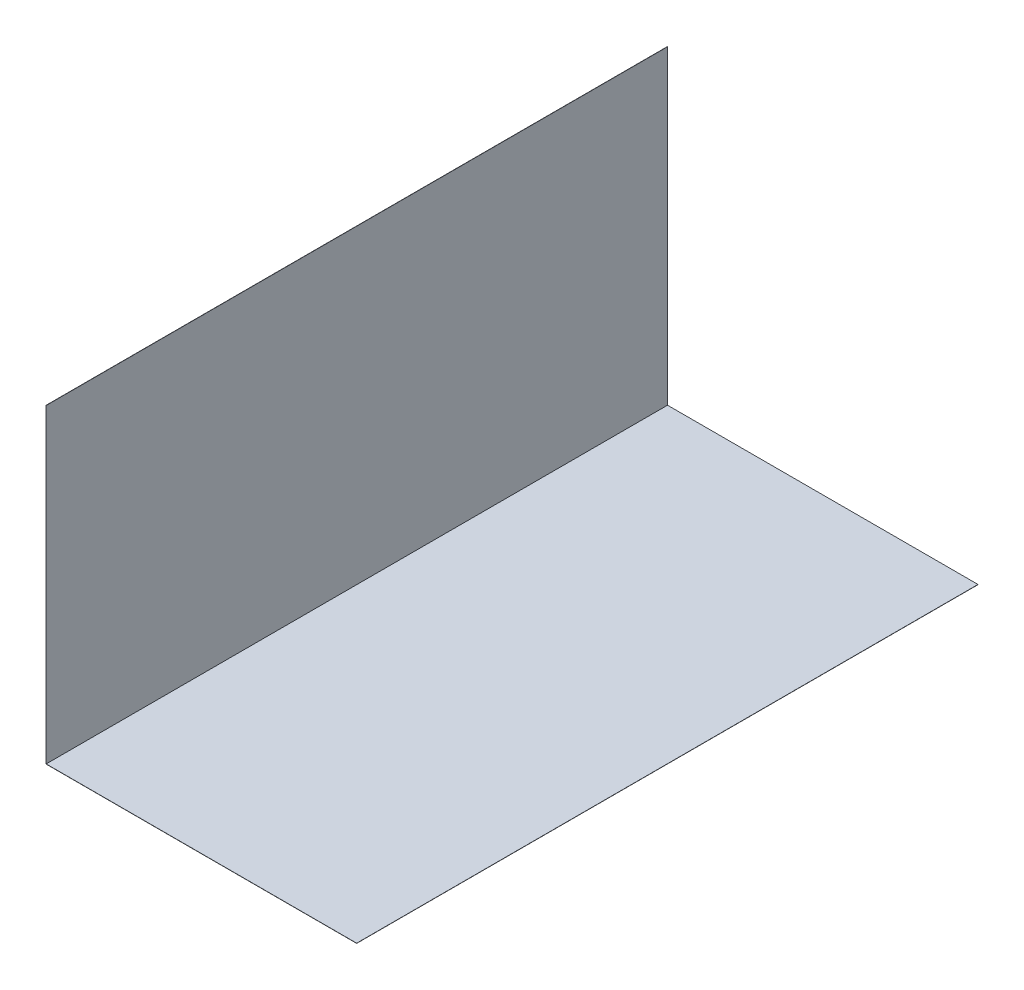
ISO-10303-21;
HEADER;
FILE_DESCRIPTION(('STEP AP214'),'2;1');
FILE_NAME('part.step','',(''),(''),'','','');
FILE_SCHEMA(('AUTOMOTIVE_DESIGN { 1 0 10303 214 1 1 1 1 }'));
ENDSEC;
DATA;
#1=APPLICATION_CONTEXT('core data for automotive mechanical design processes');
#2=APPLICATION_PROTOCOL_DEFINITION('international standard','automotive_design',2000,#1);
#3=PRODUCT_CONTEXT('',#1,'mechanical');
#4=PRODUCT('Part','Part','',(#3));
#5=PRODUCT_RELATED_PRODUCT_CATEGORY('part','',(#4));
#6=PRODUCT_DEFINITION_FORMATION('','',#4);
#7=PRODUCT_DEFINITION_CONTEXT('part definition',#1,'design');
#8=PRODUCT_DEFINITION('design','',#6,#7);
#9=PRODUCT_DEFINITION_SHAPE('','',#8);
#10=(LENGTH_UNIT() NAMED_UNIT(*) SI_UNIT(.MILLI.,.METRE.));
#11=(NAMED_UNIT(*) PLANE_ANGLE_UNIT() SI_UNIT($,.RADIAN.));
#12=(NAMED_UNIT(*) SI_UNIT($,.STERADIAN.) SOLID_ANGLE_UNIT());
#13=UNCERTAINTY_MEASURE_WITH_UNIT(LENGTH_MEASURE(1.E-05),#10,'distance_accuracy_value','');
#14=(GEOMETRIC_REPRESENTATION_CONTEXT(3) GLOBAL_UNCERTAINTY_ASSIGNED_CONTEXT((#13)) GLOBAL_UNIT_ASSIGNED_CONTEXT((#10,
#11,#12)) REPRESENTATION_CONTEXT('',''));
#15=CARTESIAN_POINT('',(0.,0.,0.));
#16=DIRECTION('',(0.,0.,1.));
#17=DIRECTION('',(1.,0.,0.));
#18=AXIS2_PLACEMENT_3D('',#15,#16,#17);
#19=CARTESIAN_POINT('',(7620.,-7610.,30480.));
#20=DIRECTION('',(-1.,0.,0.));
#21=DIRECTION('',(0.,0.,1.));
#22=AXIS2_PLACEMENT_3D('',#19,#20,#21);
#23=PLANE('',#22);
#24=DIRECTION('',(0.,1.,0.));
#25=VECTOR('',#24,1.);
#26=CARTESIAN_POINT('',(7620.,-7610.,0.));
#27=LINE('',#26,#25);
#28=CARTESIAN_POINT('',(7620.,-7620.,0.));
#29=VERTEX_POINT('',#28);
#30=CARTESIAN_POINT('',(7620.,-7610.,0.));
#31=VERTEX_POINT('',#30);
#32=EDGE_CURVE('E117',#29,#31,#27,.T.);
#33=ORIENTED_EDGE('',*,*,#32,.T.);
#34=DIRECTION('',(0.,0.,-1.));
#35=VECTOR('',#34,1.);
#36=CARTESIAN_POINT('',(7620.,-7610.,30480.));
#37=LINE('',#36,#35);
#38=CARTESIAN_POINT('',(7620.,-7610.,30480.));
#39=VERTEX_POINT('',#38);
#40=EDGE_CURVE('E11',#39,#31,#37,.T.);
#41=ORIENTED_EDGE('',*,*,#40,.F.);
#42=DIRECTION('',(0.,1.,0.));
#43=VECTOR('',#42,1.);
#44=CARTESIAN_POINT('',(7620.,-7610.,30480.));
#45=LINE('',#44,#43);
#46=CARTESIAN_POINT('',(7620.,-7620.,30480.));
#47=VERTEX_POINT('',#46);
#48=EDGE_CURVE('E127',#47,#39,#45,.T.);
#49=ORIENTED_EDGE('',*,*,#48,.F.);
#50=DIRECTION('',(0.,0.,-1.));
#51=VECTOR('',#50,1.);
#52=CARTESIAN_POINT('',(7620.,-7620.,30480.));
#53=LINE('',#52,#51);
#54=EDGE_CURVE('E113',#47,#29,#53,.T.);
#55=ORIENTED_EDGE('',*,*,#54,.T.);
#56=EDGE_LOOP('',(#33,#41,#49,#55));
#57=FACE_BOUND('',#56,.T.);
#58=ADVANCED_FACE('F33',(#57),#23,.F.);
#59=CARTESIAN_POINT('',(-7610.,-7610.,30480.));
#60=DIRECTION('',(0.,-1.,0.));
#61=DIRECTION('',(0.,0.,-1.));
#62=AXIS2_PLACEMENT_3D('',#59,#60,#61);
#63=PLANE('',#62);
#64=DIRECTION('',(-1.,0.,0.));
#65=VECTOR('',#64,1.);
#66=CARTESIAN_POINT('',(-7610.,-7610.,0.));
#67=LINE('',#66,#65);
#68=CARTESIAN_POINT('',(-7610.,-7610.,0.));
#69=VERTEX_POINT('',#68);
#70=EDGE_CURVE('E120',#31,#69,#67,.T.);
#71=ORIENTED_EDGE('',*,*,#70,.T.);
#72=DIRECTION('',(0.,0.,-1.));
#73=VECTOR('',#72,1.);
#74=CARTESIAN_POINT('',(-7610.,-7610.,30480.));
#75=LINE('',#74,#73);
#76=CARTESIAN_POINT('',(-7610.,-7610.,30480.));
#77=VERTEX_POINT('',#76);
#78=EDGE_CURVE('E41',#77,#69,#75,.T.);
#79=ORIENTED_EDGE('',*,*,#78,.F.);
#80=DIRECTION('',(-1.,0.,0.));
#81=VECTOR('',#80,1.);
#82=CARTESIAN_POINT('',(-7610.,-7610.,30480.));
#83=LINE('',#82,#81);
#84=EDGE_CURVE('E86',#39,#77,#83,.T.);
#85=ORIENTED_EDGE('',*,*,#84,.F.);
#86=ORIENTED_EDGE('',*,*,#40,.T.);
#87=EDGE_LOOP('',(#71,#79,#85,#86));
#88=FACE_BOUND('',#87,.T.);
#89=ADVANCED_FACE('F151',(#88),#63,.F.);
#90=CARTESIAN_POINT('',(-7610.,7620.,30480.));
#91=DIRECTION('',(-1.,0.,0.));
#92=DIRECTION('',(0.,0.,1.));
#93=AXIS2_PLACEMENT_3D('',#90,#91,#92);
#94=PLANE('',#93);
#95=DIRECTION('',(0.,1.,0.));
#96=VECTOR('',#95,1.);
#97=CARTESIAN_POINT('',(-7610.,7620.,0.));
#98=LINE('',#97,#96);
#99=CARTESIAN_POINT('',(-7610.,7620.,0.));
#100=VERTEX_POINT('',#99);
#101=EDGE_CURVE('E122',#69,#100,#98,.T.);
#102=ORIENTED_EDGE('',*,*,#101,.T.);
#103=DIRECTION('',(0.,0.,-1.));
#104=VECTOR('',#103,1.);
#105=CARTESIAN_POINT('',(-7610.,7620.,30480.));
#106=LINE('',#105,#104);
#107=CARTESIAN_POINT('',(-7610.,7620.,30480.));
#108=VERTEX_POINT('',#107);
#109=EDGE_CURVE('E108',#108,#100,#106,.T.);
#110=ORIENTED_EDGE('',*,*,#109,.F.);
#111=DIRECTION('',(0.,1.,0.));
#112=VECTOR('',#111,1.);
#113=CARTESIAN_POINT('',(-7610.,7620.,30480.));
#114=LINE('',#113,#112);
#115=EDGE_CURVE('E99',#77,#108,#114,.T.);
#116=ORIENTED_EDGE('',*,*,#115,.F.);
#117=ORIENTED_EDGE('',*,*,#78,.T.);
#118=EDGE_LOOP('',(#102,#110,#116,#117));
#119=FACE_BOUND('',#118,.T.);
#120=ADVANCED_FACE('F133',(#119),#94,.F.);
#121=CARTESIAN_POINT('',(-7610.,7620.,30480.));
#122=DIRECTION('',(0.,-1.,0.));
#123=DIRECTION('',(0.,0.,-1.));
#124=AXIS2_PLACEMENT_3D('',#121,#122,#123);
#125=PLANE('',#124);
#126=DIRECTION('',(-1.,0.,0.));
#127=VECTOR('',#126,1.);
#128=CARTESIAN_POINT('',(-7610.,7620.,0.));
#129=LINE('',#128,#127);
#130=CARTESIAN_POINT('',(-7620.,7620.,0.));
#131=VERTEX_POINT('',#130);
#132=EDGE_CURVE('E107',#100,#131,#129,.T.);
#133=ORIENTED_EDGE('',*,*,#132,.T.);
#134=DIRECTION('',(0.,0.,-1.));
#135=VECTOR('',#134,1.);
#136=CARTESIAN_POINT('',(-7620.,7620.,30480.));
#137=LINE('',#136,#135);
#138=CARTESIAN_POINT('',(-7620.,7620.,30480.));
#139=VERTEX_POINT('',#138);
#140=EDGE_CURVE('E104',#139,#131,#137,.T.);
#141=ORIENTED_EDGE('',*,*,#140,.F.);
#142=DIRECTION('',(-1.,0.,0.));
#143=VECTOR('',#142,1.);
#144=CARTESIAN_POINT('',(-7610.,7620.,30480.));
#145=LINE('',#144,#143);
#146=EDGE_CURVE('E93',#108,#139,#145,.T.);
#147=ORIENTED_EDGE('',*,*,#146,.F.);
#148=ORIENTED_EDGE('',*,*,#109,.T.);
#149=EDGE_LOOP('',(#133,#141,#147,#148));
#150=FACE_BOUND('',#149,.T.);
#151=ADVANCED_FACE('F105',(#150),#125,.F.);
#152=CARTESIAN_POINT('',(-7620.,7620.,30480.));
#153=DIRECTION('',(1.,0.,0.));
#154=DIRECTION('',(0.,1.,0.));
#155=AXIS2_PLACEMENT_3D('',#152,#153,#154);
#156=PLANE('',#155);
#157=DIRECTION('',(0.,-1.,0.));
#158=VECTOR('',#157,1.);
#159=CARTESIAN_POINT('',(-7620.,7620.,0.));
#160=LINE('',#159,#158);
#161=CARTESIAN_POINT('',(-7620.,-7620.,0.));
#162=VERTEX_POINT('',#161);
#163=EDGE_CURVE('E72',#131,#162,#160,.T.);
#164=ORIENTED_EDGE('',*,*,#163,.T.);
#165=DIRECTION('',(0.,0.,-1.));
#166=VECTOR('',#165,1.);
#167=CARTESIAN_POINT('',(-7620.,-7620.,30480.));
#168=LINE('',#167,#166);
#169=CARTESIAN_POINT('',(-7620.,-7620.,30480.));
#170=VERTEX_POINT('',#169);
#171=EDGE_CURVE('E109',#170,#162,#168,.T.);
#172=ORIENTED_EDGE('',*,*,#171,.F.);
#173=DIRECTION('',(0.,-1.,0.));
#174=VECTOR('',#173,1.);
#175=CARTESIAN_POINT('',(-7620.,7620.,30480.));
#176=LINE('',#175,#174);
#177=EDGE_CURVE('E97',#139,#170,#176,.T.);
#178=ORIENTED_EDGE('',*,*,#177,.F.);
#179=ORIENTED_EDGE('',*,*,#140,.T.);
#180=EDGE_LOOP('',(#164,#172,#178,#179));
#181=FACE_BOUND('',#180,.T.);
#182=ADVANCED_FACE('F111',(#181),#156,.F.);
#183=CARTESIAN_POINT('',(-7620.,-7620.,30480.));
#184=DIRECTION('',(0.,1.,0.));
#185=DIRECTION('',(0.,0.,1.));
#186=AXIS2_PLACEMENT_3D('',#183,#184,#185);
#187=PLANE('',#186);
#188=DIRECTION('',(1.,0.,0.));
#189=VECTOR('',#188,1.);
#190=CARTESIAN_POINT('',(-7620.,-7620.,0.));
#191=LINE('',#190,#189);
#192=EDGE_CURVE('E78',#162,#29,#191,.T.);
#193=ORIENTED_EDGE('',*,*,#192,.T.);
#194=ORIENTED_EDGE('',*,*,#54,.F.);
#195=DIRECTION('',(1.,0.,0.));
#196=VECTOR('',#195,1.);
#197=CARTESIAN_POINT('',(-7620.,-7620.,30480.));
#198=LINE('',#197,#196);
#199=EDGE_CURVE('E49',#170,#47,#198,.T.);
#200=ORIENTED_EDGE('',*,*,#199,.F.);
#201=ORIENTED_EDGE('',*,*,#171,.T.);
#202=EDGE_LOOP('',(#193,#194,#200,#201));
#203=FACE_BOUND('',#202,.T.);
#204=ADVANCED_FACE('F140',(#203),#187,.F.);
#205=CARTESIAN_POINT('',(0.,0.,30480.));
#206=DIRECTION('',(0.,0.,1.));
#207=DIRECTION('',(1.,0.,0.));
#208=AXIS2_PLACEMENT_3D('',#205,#206,#207);
#209=PLANE('',#208);
#210=ORIENTED_EDGE('',*,*,#48,.T.);
#211=ORIENTED_EDGE('',*,*,#84,.T.);
#212=ORIENTED_EDGE('',*,*,#115,.T.);
#213=ORIENTED_EDGE('',*,*,#146,.T.);
#214=ORIENTED_EDGE('',*,*,#177,.T.);
#215=ORIENTED_EDGE('',*,*,#199,.T.);
#216=EDGE_LOOP('',(#210,#211,#212,#213,#214,#215));
#217=FACE_BOUND('',#216,.T.);
#218=ADVANCED_FACE('F95',(#217),#209,.T.);
#219=CARTESIAN_POINT('',(0.,0.,0.));
#220=DIRECTION('',(0.,0.,1.));
#221=DIRECTION('',(1.,0.,0.));
#222=AXIS2_PLACEMENT_3D('',#219,#220,#221);
#223=PLANE('',#222);
#224=ORIENTED_EDGE('',*,*,#32,.F.);
#225=ORIENTED_EDGE('',*,*,#192,.F.);
#226=ORIENTED_EDGE('',*,*,#163,.F.);
#227=ORIENTED_EDGE('',*,*,#132,.F.);
#228=ORIENTED_EDGE('',*,*,#101,.F.);
#229=ORIENTED_EDGE('',*,*,#70,.F.);
#230=EDGE_LOOP('',(#224,#225,#226,#227,#228,#229));
#231=FACE_BOUND('',#230,.T.);
#232=ADVANCED_FACE('F136',(#231),#223,.F.);
#233=CLOSED_SHELL('',(#58,#89,#120,#151,#182,#204,#218,#232));
#234=MANIFOLD_SOLID_BREP('B2',#233);
#235=ADVANCED_BREP_SHAPE_REPRESENTATION('',(#18,#234),#14);
#236=SHAPE_DEFINITION_REPRESENTATION(#9,#235);
ENDSEC;
END-ISO-10303-21;
